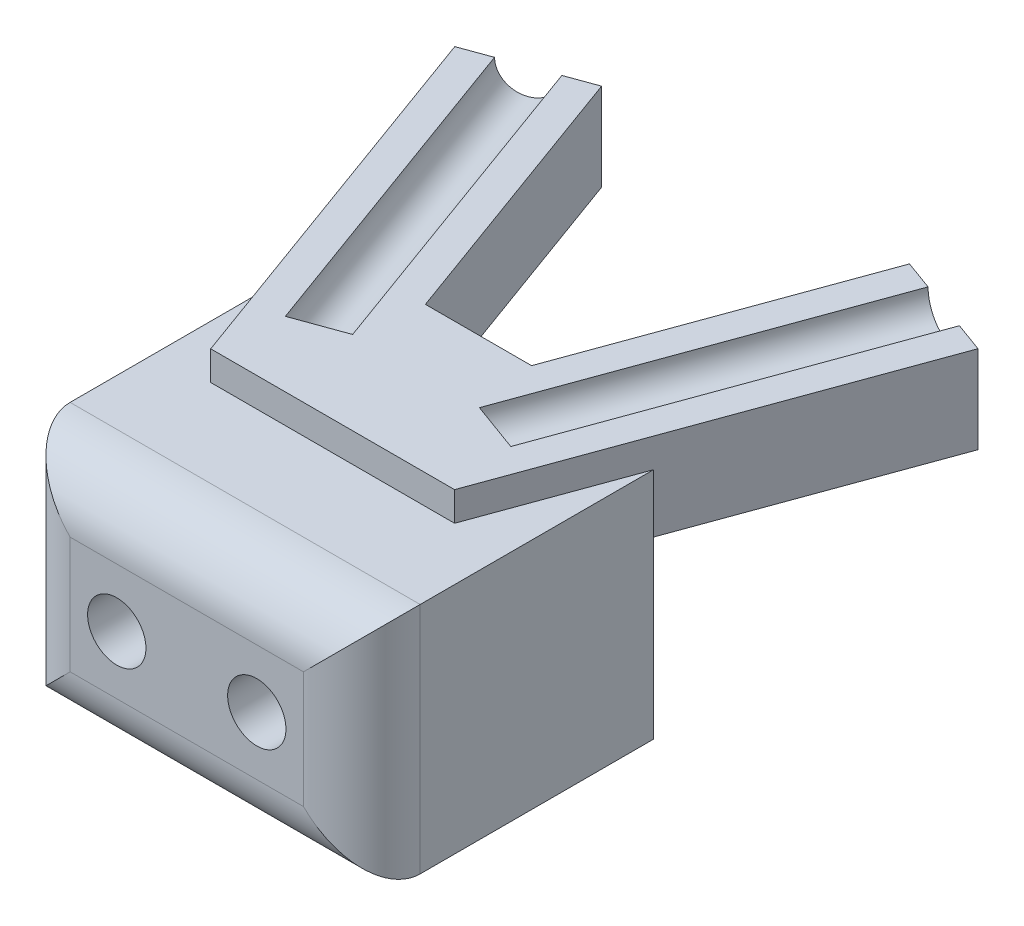
ISO-10303-21;
HEADER;
FILE_DESCRIPTION(('STEP AP214'),'2;1');
FILE_NAME('part.step','',(''),(''),'','','');
FILE_SCHEMA(('AUTOMOTIVE_DESIGN { 1 0 10303 214 1 1 1 1 }'));
ENDSEC;
DATA;
#1=APPLICATION_CONTEXT('core data for automotive mechanical design processes');
#2=APPLICATION_PROTOCOL_DEFINITION('international standard','automotive_design',2000,#1);
#3=PRODUCT_CONTEXT('',#1,'mechanical');
#4=PRODUCT('Part','Part','',(#3));
#5=PRODUCT_RELATED_PRODUCT_CATEGORY('part','',(#4));
#6=PRODUCT_DEFINITION_FORMATION('','',#4);
#7=PRODUCT_DEFINITION_CONTEXT('part definition',#1,'design');
#8=PRODUCT_DEFINITION('design','',#6,#7);
#9=PRODUCT_DEFINITION_SHAPE('','',#8);
#10=(LENGTH_UNIT() NAMED_UNIT(*) SI_UNIT(.MILLI.,.METRE.));
#11=(NAMED_UNIT(*) PLANE_ANGLE_UNIT() SI_UNIT($,.RADIAN.));
#12=(NAMED_UNIT(*) SI_UNIT($,.STERADIAN.) SOLID_ANGLE_UNIT());
#13=UNCERTAINTY_MEASURE_WITH_UNIT(LENGTH_MEASURE(1.E-05),#10,'distance_accuracy_value','');
#14=(GEOMETRIC_REPRESENTATION_CONTEXT(3) GLOBAL_UNCERTAINTY_ASSIGNED_CONTEXT((#13)) GLOBAL_UNIT_ASSIGNED_CONTEXT((#10,
#11,#12)) REPRESENTATION_CONTEXT('',''));
#15=CARTESIAN_POINT('',(0.,0.,0.));
#16=DIRECTION('',(0.,0.,1.));
#17=DIRECTION('',(1.,0.,0.));
#18=AXIS2_PLACEMENT_3D('',#15,#16,#17);
#19=CARTESIAN_POINT('',(0.,2.5,0.));
#20=DIRECTION('',(0.,1.,0.));
#21=DIRECTION('',(0.,0.,1.));
#22=AXIS2_PLACEMENT_3D('',#19,#20,#21);
#23=PLANE('',#22);
#24=DIRECTION('',(0.939692620785908,0.,0.342020143325669));
#25=VECTOR('',#24,1.);
#26=CARTESIAN_POINT('',(1.83514875293571,2.5,-5.04202976003116));
#27=LINE('',#26,#25);
#28=CARTESIAN_POINT('',(3.98428602068269,2.5,-4.25980776521908));
#29=VERTEX_POINT('',#28);
#30=CARTESIAN_POINT('',(4.48421541761415,2.5,-4.07784834550136));
#31=VERTEX_POINT('',#30);
#32=EDGE_CURVE('E210',#29,#31,#27,.T.);
#33=ORIENTED_EDGE('',*,*,#32,.F.);
#34=DIRECTION('',(0.34202014332567,0.,-0.939692620785908));
#35=VECTOR('',#34,1.);
#36=CARTESIAN_POINT('',(1.93216516072868,2.5,1.37834795949637));
#37=LINE('',#36,#35);
#38=CARTESIAN_POINT('',(1.93216516072868,2.5,1.37834795949637));
#39=VERTEX_POINT('',#38);
#40=EDGE_CURVE('E194',#29,#39,#37,.F.);
#41=ORIENTED_EDGE('',*,*,#40,.T.);
#42=DIRECTION('',(-0.939692620785908,0.,-0.34202014332567));
#43=VECTOR('',#42,1.);
#44=CARTESIAN_POINT('',(-0.216972107018303,2.5,0.596125964684276));
#45=LINE('',#44,#43);
#46=CARTESIAN_POINT('',(1.08644180202136,2.5,1.07052983050327));
#47=VERTEX_POINT('',#46);
#48=EDGE_CURVE('E297',#39,#47,#45,.T.);
#49=ORIENTED_EDGE('',*,*,#48,.T.);
#50=DIRECTION('',(0.34202014332567,0.,-0.939692620785908));
#51=VECTOR('',#50,1.);
#52=CARTESIAN_POINT('',(1.08644180202136,2.5,1.07052983050327));
#53=LINE('',#52,#51);
#54=CARTESIAN_POINT('',(3.13856266197538,2.5,-4.56762589421218));
#55=VERTEX_POINT('',#54);
#56=EDGE_CURVE('E205',#47,#55,#53,.T.);
#57=ORIENTED_EDGE('',*,*,#56,.T.);
#58=CARTESIAN_POINT('',(2.63863326504386,2.5,-4.74958531392989));
#59=VERTEX_POINT('',#58);
#60=EDGE_CURVE('E213',#59,#55,#27,.T.);
#61=ORIENTED_EDGE('',*,*,#60,.F.);
#62=DIRECTION('',(0.342020143325713,0.,-0.939692620785892));
#63=VECTOR('',#62,1.);
#64=CARTESIAN_POINT('',(0.803484512107902,2.5,0.292444446101221));
#65=LINE('',#64,#63);
#66=CARTESIAN_POINT('',(0.909925585665229,2.5,0.));
#67=VERTEX_POINT('',#66);
#68=EDGE_CURVE('E219',#67,#59,#65,.T.);
#69=ORIENTED_EDGE('',*,*,#68,.F.);
#70=DIRECTION('',(-1.,0.,0.));
#71=VECTOR('',#70,1.);
#72=CARTESIAN_POINT('',(0.,2.5,0.));
#73=LINE('',#72,#71);
#74=CARTESIAN_POINT('',(-0.909925585665234,2.5,0.));
#75=VERTEX_POINT('',#74);
#76=EDGE_CURVE('E236',#67,#75,#73,.T.);
#77=ORIENTED_EDGE('',*,*,#76,.T.);
#78=DIRECTION('',(-0.342020143325717,0.,-0.939692620785891));
#79=VECTOR('',#78,1.);
#80=CARTESIAN_POINT('',(-0.803484512107904,2.5,0.292444446101226));
#81=LINE('',#80,#79);
#82=CARTESIAN_POINT('',(-2.63863326504389,2.5,-4.74958531392989));
#83=VERTEX_POINT('',#82);
#84=EDGE_CURVE('E401',#75,#83,#81,.T.);
#85=ORIENTED_EDGE('',*,*,#84,.T.);
#86=DIRECTION('',(-0.939692620785908,0.,0.34202014332567));
#87=VECTOR('',#86,1.);
#88=CARTESIAN_POINT('',(-1.83514875293571,2.5,-5.04202976003117));
#89=LINE('',#88,#87);
#90=CARTESIAN_POINT('',(-3.13856266197538,2.5,-4.56762589421218));
#91=VERTEX_POINT('',#90);
#92=EDGE_CURVE('E404',#83,#91,#89,.T.);
#93=ORIENTED_EDGE('',*,*,#92,.T.);
#94=DIRECTION('',(-0.34202014332567,0.,-0.939692620785908));
#95=VECTOR('',#94,1.);
#96=CARTESIAN_POINT('',(-1.08644180202136,2.5,1.07052983050327));
#97=LINE('',#96,#95);
#98=CARTESIAN_POINT('',(-1.08644180202136,2.5,1.07052983050327));
#99=VERTEX_POINT('',#98);
#100=EDGE_CURVE('E295',#99,#91,#97,.T.);
#101=ORIENTED_EDGE('',*,*,#100,.F.);
#102=DIRECTION('',(-0.939692620785908,0.,0.34202014332567));
#103=VECTOR('',#102,1.);
#104=CARTESIAN_POINT('',(0.216972107018303,2.5,0.596125964684276));
#105=LINE('',#104,#103);
#106=CARTESIAN_POINT('',(-1.93216516072867,2.5,1.37834795949637));
#107=VERTEX_POINT('',#106);
#108=EDGE_CURVE('E289',#99,#107,#105,.T.);
#109=ORIENTED_EDGE('',*,*,#108,.T.);
#110=DIRECTION('',(-0.34202014332567,0.,-0.939692620785908));
#111=VECTOR('',#110,1.);
#112=CARTESIAN_POINT('',(-1.93216516072868,2.5,1.37834795949637));
#113=LINE('',#112,#111);
#114=CARTESIAN_POINT('',(-3.98428602068269,2.5,-4.25980776521908));
#115=VERTEX_POINT('',#114);
#116=EDGE_CURVE('E292',#115,#107,#113,.F.);
#117=ORIENTED_EDGE('',*,*,#116,.F.);
#118=CARTESIAN_POINT('',(-4.48421541761418,2.5,-4.07784834550136));
#119=VERTEX_POINT('',#118);
#120=EDGE_CURVE('E403',#115,#119,#89,.T.);
#121=ORIENTED_EDGE('',*,*,#120,.T.);
#122=DIRECTION('',(-0.34202014332567,0.,-0.939692620785908));
#123=VECTOR('',#122,1.);
#124=CARTESIAN_POINT('',(-2.64906666467847,2.5,0.964181414529811));
#125=LINE('',#124,#123);
#126=CARTESIAN_POINT('',(-2.09007441433449,2.5,2.5));
#127=VERTEX_POINT('',#126);
#128=EDGE_CURVE('E407',#127,#119,#125,.T.);
#129=ORIENTED_EDGE('',*,*,#128,.F.);
#130=DIRECTION('',(1.,0.,0.));
#131=VECTOR('',#130,1.);
#132=CARTESIAN_POINT('',(0.,2.5,2.5));
#133=LINE('',#132,#131);
#134=CARTESIAN_POINT('',(2.09007441433451,2.5,2.5));
#135=VERTEX_POINT('',#134);
#136=EDGE_CURVE('E220',#127,#135,#133,.T.);
#137=ORIENTED_EDGE('',*,*,#136,.T.);
#138=DIRECTION('',(0.342020143325664,0.,-0.93969262078591));
#139=VECTOR('',#138,1.);
#140=CARTESIAN_POINT('',(2.64906666467848,2.5,0.964181414529797));
#141=LINE('',#140,#139);
#142=EDGE_CURVE('E216',#135,#31,#141,.T.);
#143=ORIENTED_EDGE('',*,*,#142,.T.);
#144=EDGE_LOOP('',(#33,#41,#49,#57,#61,#69,#77,#85,#93,#101,#109,#117,#121,#129,#137,#143));
#145=FACE_BOUND('',#144,.T.);
#146=ADVANCED_FACE('F62',(#145),#23,.T.);
#147=CARTESIAN_POINT('',(0.,0.,0.));
#148=DIRECTION('',(0.,0.,1.));
#149=DIRECTION('',(1.,0.,0.));
#150=AXIS2_PLACEMENT_3D('',#147,#148,#149);
#151=PLANE('',#150);
#152=CARTESIAN_POINT('',(-1.2,0.,0.));
#153=DIRECTION('',(0.,0.,-1.));
#154=DIRECTION('',(1.,0.,0.));
#155=AXIS2_PLACEMENT_3D('',#152,#153,#154);
#156=CIRCLE('',#155,0.500000000000001);
#157=CARTESIAN_POINT('',(-0.699999999999999,0.,0.));
#158=VERTEX_POINT('',#157);
#159=EDGE_CURVE('E261',#158,#158,#156,.T.);
#160=ORIENTED_EDGE('',*,*,#159,.F.);
#161=EDGE_LOOP('',(#160));
#162=FACE_BOUND('',#161,.T.);
#163=CARTESIAN_POINT('',(1.2,0.,0.));
#164=DIRECTION('',(0.,0.,-1.));
#165=DIRECTION('',(-1.,0.,0.));
#166=AXIS2_PLACEMENT_3D('',#163,#164,#165);
#167=CIRCLE('',#166,0.5);
#168=CARTESIAN_POINT('',(0.7,0.,0.));
#169=VERTEX_POINT('',#168);
#170=EDGE_CURVE('E258',#169,#169,#167,.T.);
#171=ORIENTED_EDGE('',*,*,#170,.F.);
#172=EDGE_LOOP('',(#171));
#173=FACE_BOUND('',#172,.T.);
#174=DIRECTION('',(0.,-1.,0.));
#175=VECTOR('',#174,1.);
#176=CARTESIAN_POINT('',(0.909925585665229,2.5,0.));
#177=LINE('',#176,#175);
#178=CARTESIAN_POINT('',(0.909925585665229,1.,0.));
#179=VERTEX_POINT('',#178);
#180=EDGE_CURVE('E226',#67,#179,#177,.T.);
#181=ORIENTED_EDGE('',*,*,#180,.T.);
#182=DIRECTION('',(-1.,0.,0.));
#183=VECTOR('',#182,1.);
#184=CARTESIAN_POINT('',(0.,1.,0.));
#185=LINE('',#184,#183);
#186=CARTESIAN_POINT('',(3.,1.,0.));
#187=VERTEX_POINT('',#186);
#188=EDGE_CURVE('E286',#187,#179,#185,.T.);
#189=ORIENTED_EDGE('',*,*,#188,.F.);
#190=DIRECTION('',(0.,1.,0.));
#191=VECTOR('',#190,1.);
#192=CARTESIAN_POINT('',(3.,2.,0.));
#193=LINE('',#192,#191);
#194=CARTESIAN_POINT('',(3.,-2.,0.));
#195=VERTEX_POINT('',#194);
#196=EDGE_CURVE('E257',#195,#187,#193,.T.);
#197=ORIENTED_EDGE('',*,*,#196,.F.);
#198=DIRECTION('',(1.,0.,0.));
#199=VECTOR('',#198,1.);
#200=CARTESIAN_POINT('',(-3.,-2.,0.));
#201=LINE('',#200,#199);
#202=CARTESIAN_POINT('',(-3.,-2.,0.));
#203=VERTEX_POINT('',#202);
#204=EDGE_CURVE('E272',#203,#195,#201,.T.);
#205=ORIENTED_EDGE('',*,*,#204,.F.);
#206=DIRECTION('',(0.,-1.,0.));
#207=VECTOR('',#206,1.);
#208=CARTESIAN_POINT('',(-3.,2.,0.));
#209=LINE('',#208,#207);
#210=CARTESIAN_POINT('',(-3.,1.,0.));
#211=VERTEX_POINT('',#210);
#212=EDGE_CURVE('E268',#211,#203,#209,.T.);
#213=ORIENTED_EDGE('',*,*,#212,.F.);
#214=DIRECTION('',(-1.,0.,0.));
#215=VECTOR('',#214,1.);
#216=CARTESIAN_POINT('',(0.,1.,0.));
#217=LINE('',#216,#215);
#218=CARTESIAN_POINT('',(-0.909925585665234,1.,0.));
#219=VERTEX_POINT('',#218);
#220=EDGE_CURVE('E283',#219,#211,#217,.T.);
#221=ORIENTED_EDGE('',*,*,#220,.F.);
#222=DIRECTION('',(0.,-1.,0.));
#223=VECTOR('',#222,1.);
#224=CARTESIAN_POINT('',(-0.909925585665234,2.5,0.));
#225=LINE('',#224,#223);
#226=EDGE_CURVE('E251',#75,#219,#225,.T.);
#227=ORIENTED_EDGE('',*,*,#226,.F.);
#228=ORIENTED_EDGE('',*,*,#76,.F.);
#229=EDGE_LOOP('',(#181,#189,#197,#205,#213,#221,#227,#228));
#230=FACE_BOUND('',#229,.T.);
#231=ADVANCED_FACE('F359',(#162,#173,#230),#151,.F.);
#232=CARTESIAN_POINT('',(-3.,2.,5.));
#233=DIRECTION('',(0.,-1.,0.));
#234=DIRECTION('',(0.,0.,-1.));
#235=AXIS2_PLACEMENT_3D('',#232,#233,#234);
#236=PLANE('',#235);
#237=DIRECTION('',(0.,0.,-1.));
#238=VECTOR('',#237,1.);
#239=CARTESIAN_POINT('',(-3.,2.,5.));
#240=LINE('',#239,#238);
#241=CARTESIAN_POINT('',(-3.,2.,4.));
#242=VERTEX_POINT('',#241);
#243=CARTESIAN_POINT('',(-3.,2.,0.));
#244=VERTEX_POINT('',#243);
#245=EDGE_CURVE('E279',#242,#244,#240,.T.);
#246=ORIENTED_EDGE('',*,*,#245,.F.);
#247=DIRECTION('',(-1.,0.,0.));
#248=VECTOR('',#247,1.);
#249=CARTESIAN_POINT('',(3.,2.,4.));
#250=LINE('',#249,#248);
#251=CARTESIAN_POINT('',(3.,2.,4.));
#252=VERTEX_POINT('',#251);
#253=EDGE_CURVE('E12',#242,#252,#250,.F.);
#254=ORIENTED_EDGE('',*,*,#253,.T.);
#255=DIRECTION('',(0.,0.,-1.));
#256=VECTOR('',#255,1.);
#257=CARTESIAN_POINT('',(3.,2.,5.));
#258=LINE('',#257,#256);
#259=CARTESIAN_POINT('',(3.,2.,0.));
#260=VERTEX_POINT('',#259);
#261=EDGE_CURVE('E281',#252,#260,#258,.T.);
#262=ORIENTED_EDGE('',*,*,#261,.T.);
#263=DIRECTION('',(0.342020143325664,0.,-0.93969262078591));
#264=VECTOR('',#263,1.);
#265=CARTESIAN_POINT('',(2.64906666467848,2.,0.964181414529797));
#266=LINE('',#265,#264);
#267=CARTESIAN_POINT('',(2.09007441433451,2.,2.5));
#268=VERTEX_POINT('',#267);
#269=EDGE_CURVE('E233',#268,#260,#266,.T.);
#270=ORIENTED_EDGE('',*,*,#269,.F.);
#271=DIRECTION('',(1.,0.,0.));
#272=VECTOR('',#271,1.);
#273=CARTESIAN_POINT('',(0.,2.,2.5));
#274=LINE('',#273,#272);
#275=CARTESIAN_POINT('',(-2.09007441433449,2.,2.5));
#276=VERTEX_POINT('',#275);
#277=EDGE_CURVE('E230',#276,#268,#274,.T.);
#278=ORIENTED_EDGE('',*,*,#277,.F.);
#279=DIRECTION('',(-0.34202014332567,0.,-0.939692620785908));
#280=VECTOR('',#279,1.);
#281=CARTESIAN_POINT('',(-2.64906666467847,2.,0.964181414529811));
#282=LINE('',#281,#280);
#283=EDGE_CURVE('E227',#276,#244,#282,.T.);
#284=ORIENTED_EDGE('',*,*,#283,.T.);
#285=EDGE_LOOP('',(#246,#254,#262,#270,#278,#284));
#286=FACE_BOUND('',#285,.T.);
#287=ADVANCED_FACE('F362',(#286),#236,.F.);
#288=CARTESIAN_POINT('',(3.,2.,5.));
#289=DIRECTION('',(-1.,0.,0.));
#290=DIRECTION('',(0.,0.,1.));
#291=AXIS2_PLACEMENT_3D('',#288,#289,#290);
#292=PLANE('',#291);
#293=ORIENTED_EDGE('',*,*,#261,.F.);
#294=DIRECTION('',(0.,1.,0.));
#295=VECTOR('',#294,1.);
#296=CARTESIAN_POINT('',(3.,-2.,4.));
#297=LINE('',#296,#295);
#298=CARTESIAN_POINT('',(3.,-2.,4.));
#299=VERTEX_POINT('',#298);
#300=EDGE_CURVE('E79',#252,#299,#297,.F.);
#301=ORIENTED_EDGE('',*,*,#300,.T.);
#302=DIRECTION('',(0.,0.,-1.));
#303=VECTOR('',#302,1.);
#304=CARTESIAN_POINT('',(3.,-2.,5.));
#305=LINE('',#304,#303);
#306=EDGE_CURVE('E275',#299,#195,#305,.T.);
#307=ORIENTED_EDGE('',*,*,#306,.T.);
#308=ORIENTED_EDGE('',*,*,#196,.T.);
#309=DIRECTION('',(0.,1.,0.));
#310=VECTOR('',#309,1.);
#311=CARTESIAN_POINT('',(3.,0.,0.));
#312=LINE('',#311,#310);
#313=EDGE_CURVE('E385',#187,#260,#312,.T.);
#314=ORIENTED_EDGE('',*,*,#313,.T.);
#315=EDGE_LOOP('',(#293,#301,#307,#308,#314));
#316=FACE_BOUND('',#315,.T.);
#317=ADVANCED_FACE('F444',(#316),#292,.F.);
#318=CARTESIAN_POINT('',(-3.,2.,5.));
#319=DIRECTION('',(1.,0.,0.));
#320=DIRECTION('',(0.,1.,0.));
#321=AXIS2_PLACEMENT_3D('',#318,#319,#320);
#322=PLANE('',#321);
#323=DIRECTION('',(0.,0.,-1.));
#324=VECTOR('',#323,1.);
#325=CARTESIAN_POINT('',(-3.,-2.,5.));
#326=LINE('',#325,#324);
#327=CARTESIAN_POINT('',(-3.,-2.,4.));
#328=VERTEX_POINT('',#327);
#329=EDGE_CURVE('E277',#328,#203,#326,.T.);
#330=ORIENTED_EDGE('',*,*,#329,.F.);
#331=DIRECTION('',(0.,-1.,0.));
#332=VECTOR('',#331,1.);
#333=CARTESIAN_POINT('',(-3.,2.,4.));
#334=LINE('',#333,#332);
#335=EDGE_CURVE('E308',#328,#242,#334,.F.);
#336=ORIENTED_EDGE('',*,*,#335,.T.);
#337=ORIENTED_EDGE('',*,*,#245,.T.);
#338=EDGE_CURVE('E269',#244,#211,#209,.T.);
#339=ORIENTED_EDGE('',*,*,#338,.T.);
#340=ORIENTED_EDGE('',*,*,#212,.T.);
#341=EDGE_LOOP('',(#330,#336,#337,#339,#340));
#342=FACE_BOUND('',#341,.T.);
#343=ADVANCED_FACE('F338',(#342),#322,.F.);
#344=CARTESIAN_POINT('',(-3.,-2.,5.));
#345=DIRECTION('',(0.,1.,0.));
#346=DIRECTION('',(0.,0.,1.));
#347=AXIS2_PLACEMENT_3D('',#344,#345,#346);
#348=PLANE('',#347);
#349=ORIENTED_EDGE('',*,*,#306,.F.);
#350=DIRECTION('',(1.,0.,0.));
#351=VECTOR('',#350,1.);
#352=CARTESIAN_POINT('',(-3.,-2.,4.));
#353=LINE('',#352,#351);
#354=EDGE_CURVE('E71',#299,#328,#353,.F.);
#355=ORIENTED_EDGE('',*,*,#354,.T.);
#356=ORIENTED_EDGE('',*,*,#329,.T.);
#357=ORIENTED_EDGE('',*,*,#204,.T.);
#358=EDGE_LOOP('',(#349,#355,#356,#357));
#359=FACE_BOUND('',#358,.T.);
#360=ADVANCED_FACE('F334',(#359),#348,.F.);
#361=CARTESIAN_POINT('',(0.,0.,5.));
#362=DIRECTION('',(0.,0.,1.));
#363=DIRECTION('',(1.,0.,0.));
#364=AXIS2_PLACEMENT_3D('',#361,#362,#363);
#365=PLANE('',#364);
#366=DIRECTION('',(0.,-1.,0.));
#367=VECTOR('',#366,1.);
#368=CARTESIAN_POINT('',(-2.,-2.,5.));
#369=LINE('',#368,#367);
#370=CARTESIAN_POINT('',(-2.,1.,5.));
#371=VERTEX_POINT('',#370);
#372=CARTESIAN_POINT('',(-2.,-1.,5.));
#373=VERTEX_POINT('',#372);
#374=EDGE_CURVE('E303',#371,#373,#369,.T.);
#375=ORIENTED_EDGE('',*,*,#374,.T.);
#376=DIRECTION('',(1.,0.,0.));
#377=VECTOR('',#376,1.);
#378=CARTESIAN_POINT('',(3.,-1.,5.));
#379=LINE('',#378,#377);
#380=CARTESIAN_POINT('',(2.,-1.,5.));
#381=VERTEX_POINT('',#380);
#382=EDGE_CURVE('E306',#373,#381,#379,.T.);
#383=ORIENTED_EDGE('',*,*,#382,.T.);
#384=DIRECTION('',(0.,1.,0.));
#385=VECTOR('',#384,1.);
#386=CARTESIAN_POINT('',(2.,2.,5.));
#387=LINE('',#386,#385);
#388=CARTESIAN_POINT('',(2.,1.,5.));
#389=VERTEX_POINT('',#388);
#390=EDGE_CURVE('E301',#381,#389,#387,.T.);
#391=ORIENTED_EDGE('',*,*,#390,.T.);
#392=DIRECTION('',(-1.,0.,0.));
#393=VECTOR('',#392,1.);
#394=CARTESIAN_POINT('',(-3.,1.,5.));
#395=LINE('',#394,#393);
#396=EDGE_CURVE('E204',#389,#371,#395,.T.);
#397=ORIENTED_EDGE('',*,*,#396,.T.);
#398=EDGE_LOOP('',(#375,#383,#391,#397));
#399=FACE_BOUND('',#398,.T.);
#400=CARTESIAN_POINT('',(1.2,0.,5.));
#401=DIRECTION('',(0.,0.,-1.));
#402=DIRECTION('',(-1.,0.,0.));
#403=AXIS2_PLACEMENT_3D('',#400,#401,#402);
#404=CIRCLE('',#403,0.5);
#405=CARTESIAN_POINT('',(0.7,0.,5.));
#406=VERTEX_POINT('',#405);
#407=EDGE_CURVE('E254',#406,#406,#404,.T.);
#408=ORIENTED_EDGE('',*,*,#407,.T.);
#409=EDGE_LOOP('',(#408));
#410=FACE_BOUND('',#409,.T.);
#411=CARTESIAN_POINT('',(-1.2,0.,5.));
#412=DIRECTION('',(0.,0.,-1.));
#413=DIRECTION('',(1.,0.,0.));
#414=AXIS2_PLACEMENT_3D('',#411,#412,#413);
#415=CIRCLE('',#414,0.500000000000001);
#416=CARTESIAN_POINT('',(-0.699999999999999,0.,5.));
#417=VERTEX_POINT('',#416);
#418=EDGE_CURVE('E253',#417,#417,#415,.T.);
#419=ORIENTED_EDGE('',*,*,#418,.T.);
#420=EDGE_LOOP('',(#419));
#421=FACE_BOUND('',#420,.T.);
#422=ADVANCED_FACE('F344',(#399,#410,#421),#365,.T.);
#423=CARTESIAN_POINT('',(-1.2,0.,5.));
#424=DIRECTION('',(0.,0.,-1.));
#425=DIRECTION('',(-1.,0.,0.));
#426=AXIS2_PLACEMENT_3D('',#423,#424,#425);
#427=CYLINDRICAL_SURFACE('',#426,0.500000000000001);
#428=ORIENTED_EDGE('',*,*,#418,.F.);
#429=EDGE_LOOP('',(#428));
#430=FACE_BOUND('',#429,.T.);
#431=ORIENTED_EDGE('',*,*,#159,.T.);
#432=EDGE_LOOP('',(#431));
#433=FACE_BOUND('',#432,.T.);
#434=ADVANCED_FACE('F347',(#430,#433),#427,.F.);
#435=CARTESIAN_POINT('',(1.2,0.,5.));
#436=DIRECTION('',(0.,0.,-1.));
#437=DIRECTION('',(-1.,0.,0.));
#438=AXIS2_PLACEMENT_3D('',#435,#436,#437);
#439=CYLINDRICAL_SURFACE('',#438,0.5);
#440=ORIENTED_EDGE('',*,*,#407,.F.);
#441=EDGE_LOOP('',(#440));
#442=FACE_BOUND('',#441,.T.);
#443=ORIENTED_EDGE('',*,*,#170,.T.);
#444=EDGE_LOOP('',(#443));
#445=FACE_BOUND('',#444,.T.);
#446=ADVANCED_FACE('F355',(#442,#445),#439,.F.);
#447=CARTESIAN_POINT('',(-0.803484512107904,2.5,0.292444446101226));
#448=DIRECTION('',(-0.939692620785891,0.,0.342020143325717));
#449=DIRECTION('',(0.342020143325717,0.,0.939692620785891));
#450=AXIS2_PLACEMENT_3D('',#447,#448,#449);
#451=PLANE('',#450);
#452=ORIENTED_EDGE('',*,*,#226,.T.);
#453=DIRECTION('',(-0.342020143325717,0.,-0.939692620785891));
#454=VECTOR('',#453,1.);
#455=CARTESIAN_POINT('',(-0.803484512107904,1.,0.292444446101226));
#456=LINE('',#455,#454);
#457=CARTESIAN_POINT('',(-2.63863326504389,1.,-4.74958531392989));
#458=VERTEX_POINT('',#457);
#459=EDGE_CURVE('E392',#219,#458,#456,.T.);
#460=ORIENTED_EDGE('',*,*,#459,.T.);
#461=DIRECTION('',(0.,-1.,0.));
#462=VECTOR('',#461,1.);
#463=CARTESIAN_POINT('',(-2.63863326504389,2.5,-4.74958531392989));
#464=LINE('',#463,#462);
#465=EDGE_CURVE('E249',#83,#458,#464,.T.);
#466=ORIENTED_EDGE('',*,*,#465,.F.);
#467=ORIENTED_EDGE('',*,*,#84,.F.);
#468=EDGE_LOOP('',(#452,#460,#466,#467));
#469=FACE_BOUND('',#468,.T.);
#470=ADVANCED_FACE('F451',(#469),#451,.F.);
#471=CARTESIAN_POINT('',(-1.83514875293571,2.5,-5.04202976003117));
#472=DIRECTION('',(0.34202014332567,0.,0.939692620785908));
#473=DIRECTION('',(0.939692620785908,0.,-0.34202014332567));
#474=AXIS2_PLACEMENT_3D('',#471,#472,#473);
#475=PLANE('',#474);
#476=ORIENTED_EDGE('',*,*,#120,.F.);
#477=CARTESIAN_POINT('',(-3.56142434132903,2.5,-4.41371682971563));
#478=DIRECTION('',(-0.34202014332567,0.,-0.939692620785908));
#479=DIRECTION('',(-0.939692620785908,0.,0.34202014332567));
#480=AXIS2_PLACEMENT_3D('',#477,#478,#479);
#481=CIRCLE('',#480,0.45);
#482=EDGE_CURVE('E421',#91,#115,#481,.T.);
#483=ORIENTED_EDGE('',*,*,#482,.F.);
#484=ORIENTED_EDGE('',*,*,#92,.F.);
#485=ORIENTED_EDGE('',*,*,#465,.T.);
#486=DIRECTION('',(-0.939692620785908,0.,0.34202014332567));
#487=VECTOR('',#486,1.);
#488=CARTESIAN_POINT('',(-1.83514875293571,1.,-5.04202976003117));
#489=LINE('',#488,#487);
#490=CARTESIAN_POINT('',(-4.48421541761418,1.,-4.07784834550136));
#491=VERTEX_POINT('',#490);
#492=EDGE_CURVE('E395',#458,#491,#489,.T.);
#493=ORIENTED_EDGE('',*,*,#492,.T.);
#494=DIRECTION('',(0.,-1.,0.));
#495=VECTOR('',#494,1.);
#496=CARTESIAN_POINT('',(-4.48421541761418,2.5,-4.07784834550136));
#497=LINE('',#496,#495);
#498=EDGE_CURVE('E247',#119,#491,#497,.T.);
#499=ORIENTED_EDGE('',*,*,#498,.F.);
#500=EDGE_LOOP('',(#476,#483,#484,#485,#493,#499));
#501=FACE_BOUND('',#500,.T.);
#502=ADVANCED_FACE('F436',(#501),#475,.F.);
#503=CARTESIAN_POINT('',(-2.64906666467847,2.5,0.964181414529811));
#504=DIRECTION('',(-0.939692620785908,0.,0.342020143325669));
#505=DIRECTION('',(0.34202014332567,0.,0.939692620785908));
#506=AXIS2_PLACEMENT_3D('',#503,#504,#505);
#507=PLANE('',#506);
#508=ORIENTED_EDGE('',*,*,#283,.F.);
#509=DIRECTION('',(0.,-1.,0.));
#510=VECTOR('',#509,1.);
#511=CARTESIAN_POINT('',(-2.09007441433449,2.5,2.5));
#512=LINE('',#511,#510);
#513=EDGE_CURVE('E245',#127,#276,#512,.T.);
#514=ORIENTED_EDGE('',*,*,#513,.F.);
#515=ORIENTED_EDGE('',*,*,#128,.T.);
#516=ORIENTED_EDGE('',*,*,#498,.T.);
#517=DIRECTION('',(-0.34202014332567,0.,-0.939692620785908));
#518=VECTOR('',#517,1.);
#519=CARTESIAN_POINT('',(-2.64906666467847,1.,0.964181414529811));
#520=LINE('',#519,#518);
#521=EDGE_CURVE('E231',#211,#491,#520,.T.);
#522=ORIENTED_EDGE('',*,*,#521,.F.);
#523=ORIENTED_EDGE('',*,*,#338,.F.);
#524=EDGE_LOOP('',(#508,#514,#515,#516,#522,#523));
#525=FACE_BOUND('',#524,.T.);
#526=ADVANCED_FACE('F442',(#525),#507,.T.);
#527=CARTESIAN_POINT('',(0.,2.5,2.5));
#528=DIRECTION('',(0.,0.,-1.));
#529=DIRECTION('',(-1.,0.,0.));
#530=AXIS2_PLACEMENT_3D('',#527,#528,#529);
#531=PLANE('',#530);
#532=ORIENTED_EDGE('',*,*,#277,.T.);
#533=DIRECTION('',(0.,-1.,0.));
#534=VECTOR('',#533,1.);
#535=CARTESIAN_POINT('',(2.09007441433451,2.5,2.5));
#536=LINE('',#535,#534);
#537=EDGE_CURVE('E242',#135,#268,#536,.T.);
#538=ORIENTED_EDGE('',*,*,#537,.F.);
#539=ORIENTED_EDGE('',*,*,#136,.F.);
#540=ORIENTED_EDGE('',*,*,#513,.T.);
#541=EDGE_LOOP('',(#532,#538,#539,#540));
#542=FACE_BOUND('',#541,.T.);
#543=ADVANCED_FACE('F413',(#542),#531,.F.);
#544=CARTESIAN_POINT('',(2.64906666467848,2.5,0.964181414529797));
#545=DIRECTION('',(-0.93969262078591,0.,-0.342020143325664));
#546=DIRECTION('',(-0.342020143325664,0.,0.93969262078591));
#547=AXIS2_PLACEMENT_3D('',#544,#545,#546);
#548=PLANE('',#547);
#549=ORIENTED_EDGE('',*,*,#269,.T.);
#550=ORIENTED_EDGE('',*,*,#313,.F.);
#551=DIRECTION('',(0.342020143325664,0.,-0.93969262078591));
#552=VECTOR('',#551,1.);
#553=CARTESIAN_POINT('',(2.64906666467848,1.,0.964181414529797));
#554=LINE('',#553,#552);
#555=CARTESIAN_POINT('',(4.48421541761415,1.,-4.07784834550136));
#556=VERTEX_POINT('',#555);
#557=EDGE_CURVE('E381',#187,#556,#554,.T.);
#558=ORIENTED_EDGE('',*,*,#557,.T.);
#559=DIRECTION('',(0.,-1.,0.));
#560=VECTOR('',#559,1.);
#561=CARTESIAN_POINT('',(4.48421541761415,2.5,-4.07784834550136));
#562=LINE('',#561,#560);
#563=EDGE_CURVE('E240',#31,#556,#562,.T.);
#564=ORIENTED_EDGE('',*,*,#563,.F.);
#565=ORIENTED_EDGE('',*,*,#142,.F.);
#566=ORIENTED_EDGE('',*,*,#537,.T.);
#567=EDGE_LOOP('',(#549,#550,#558,#564,#565,#566));
#568=FACE_BOUND('',#567,.T.);
#569=ADVANCED_FACE('F417',(#568),#548,.F.);
#570=CARTESIAN_POINT('',(1.83514875293571,2.5,-5.04202976003116));
#571=DIRECTION('',(0.342020143325669,0.,-0.939692620785908));
#572=DIRECTION('',(-0.939692620785908,0.,-0.342020143325669));
#573=AXIS2_PLACEMENT_3D('',#570,#571,#572);
#574=PLANE('',#573);
#575=ORIENTED_EDGE('',*,*,#60,.T.);
#576=CARTESIAN_POINT('',(3.56142434132903,2.5,-4.41371682971563));
#577=DIRECTION('',(-0.34202014332567,0.,0.939692620785908));
#578=DIRECTION('',(0.939692620785908,0.,0.34202014332567));
#579=AXIS2_PLACEMENT_3D('',#576,#577,#578);
#580=CIRCLE('',#579,0.45);
#581=EDGE_CURVE('E198',#55,#29,#580,.T.);
#582=ORIENTED_EDGE('',*,*,#581,.T.);
#583=ORIENTED_EDGE('',*,*,#32,.T.);
#584=ORIENTED_EDGE('',*,*,#563,.T.);
#585=DIRECTION('',(0.939692620785908,0.,0.342020143325669));
#586=VECTOR('',#585,1.);
#587=CARTESIAN_POINT('',(1.83514875293571,1.,-5.04202976003116));
#588=LINE('',#587,#586);
#589=CARTESIAN_POINT('',(2.63863326504386,1.,-4.74958531392989));
#590=VERTEX_POINT('',#589);
#591=EDGE_CURVE('E383',#590,#556,#588,.T.);
#592=ORIENTED_EDGE('',*,*,#591,.F.);
#593=DIRECTION('',(0.,-1.,0.));
#594=VECTOR('',#593,1.);
#595=CARTESIAN_POINT('',(2.63863326504386,2.5,-4.74958531392989));
#596=LINE('',#595,#594);
#597=EDGE_CURVE('E238',#59,#590,#596,.T.);
#598=ORIENTED_EDGE('',*,*,#597,.F.);
#599=EDGE_LOOP('',(#575,#582,#583,#584,#592,#598));
#600=FACE_BOUND('',#599,.T.);
#601=ADVANCED_FACE('F209',(#600),#574,.T.);
#602=CARTESIAN_POINT('',(0.803484512107902,2.5,0.292444446101221));
#603=DIRECTION('',(-0.939692620785892,0.,-0.342020143325713));
#604=DIRECTION('',(-0.342020143325713,0.,0.939692620785892));
#605=AXIS2_PLACEMENT_3D('',#602,#603,#604);
#606=PLANE('',#605);
#607=ORIENTED_EDGE('',*,*,#597,.T.);
#608=DIRECTION('',(0.342020143325713,0.,-0.939692620785892));
#609=VECTOR('',#608,1.);
#610=CARTESIAN_POINT('',(0.803484512107902,1.,0.292444446101221));
#611=LINE('',#610,#609);
#612=EDGE_CURVE('E378',#179,#590,#611,.T.);
#613=ORIENTED_EDGE('',*,*,#612,.F.);
#614=ORIENTED_EDGE('',*,*,#180,.F.);
#615=ORIENTED_EDGE('',*,*,#68,.T.);
#616=EDGE_LOOP('',(#607,#613,#614,#615));
#617=FACE_BOUND('',#616,.T.);
#618=ADVANCED_FACE('F382',(#617),#606,.T.);
#619=CARTESIAN_POINT('',(0.,1.,0.));
#620=DIRECTION('',(0.,1.,0.));
#621=DIRECTION('',(0.,0.,1.));
#622=AXIS2_PLACEMENT_3D('',#619,#620,#621);
#623=PLANE('',#622);
#624=ORIENTED_EDGE('',*,*,#459,.F.);
#625=ORIENTED_EDGE('',*,*,#220,.T.);
#626=ORIENTED_EDGE('',*,*,#521,.T.);
#627=ORIENTED_EDGE('',*,*,#492,.F.);
#628=EDGE_LOOP('',(#624,#625,#626,#627));
#629=FACE_BOUND('',#628,.T.);
#630=ADVANCED_FACE('F448',(#629),#623,.F.);
#631=CARTESIAN_POINT('',(0.,1.,0.));
#632=DIRECTION('',(0.,1.,0.));
#633=DIRECTION('',(0.,0.,1.));
#634=AXIS2_PLACEMENT_3D('',#631,#632,#633);
#635=PLANE('',#634);
#636=ORIENTED_EDGE('',*,*,#557,.F.);
#637=ORIENTED_EDGE('',*,*,#188,.T.);
#638=ORIENTED_EDGE('',*,*,#612,.T.);
#639=ORIENTED_EDGE('',*,*,#591,.T.);
#640=EDGE_LOOP('',(#636,#637,#638,#639));
#641=FACE_BOUND('',#640,.T.);
#642=ADVANCED_FACE('F376',(#641),#635,.F.);
#643=CARTESIAN_POINT('',(-1.50930348137502,2.5,1.22443889499982));
#644=DIRECTION('',(-0.34202014332567,0.,-0.939692620785908));
#645=DIRECTION('',(-0.939692620785908,0.,0.34202014332567));
#646=AXIS2_PLACEMENT_3D('',#643,#644,#645);
#647=CYLINDRICAL_SURFACE('',#646,0.45);
#648=ORIENTED_EDGE('',*,*,#100,.T.);
#649=ORIENTED_EDGE('',*,*,#482,.T.);
#650=ORIENTED_EDGE('',*,*,#116,.T.);
#651=CARTESIAN_POINT('',(-1.50930348137502,2.5,1.22443889499982));
#652=DIRECTION('',(-0.34202014332567,0.,-0.939692620785908));
#653=DIRECTION('',(-0.939692620785908,0.,0.34202014332567));
#654=AXIS2_PLACEMENT_3D('',#651,#652,#653);
#655=CIRCLE('',#654,0.45);
#656=EDGE_CURVE('E387',#99,#107,#655,.T.);
#657=ORIENTED_EDGE('',*,*,#656,.F.);
#658=EDGE_LOOP('',(#648,#649,#650,#657));
#659=FACE_BOUND('',#658,.T.);
#660=ADVANCED_FACE('F431',(#659),#647,.F.);
#661=CARTESIAN_POINT('',(-1.50930348137502,2.5,1.22443889499982));
#662=DIRECTION('',(-0.34202014332567,0.,-0.939692620785908));
#663=DIRECTION('',(-0.939692620785908,0.,0.34202014332567));
#664=AXIS2_PLACEMENT_3D('',#661,#662,#663);
#665=PLANE('',#664);
#666=ORIENTED_EDGE('',*,*,#656,.T.);
#667=ORIENTED_EDGE('',*,*,#108,.F.);
#668=EDGE_LOOP('',(#666,#667));
#669=FACE_BOUND('',#668,.T.);
#670=ADVANCED_FACE('F427',(#669),#665,.T.);
#671=CARTESIAN_POINT('',(1.50930348137502,2.5,1.22443889499982));
#672=DIRECTION('',(0.34202014332567,0.,-0.939692620785908));
#673=DIRECTION('',(-0.939692620785908,0.,-0.34202014332567));
#674=AXIS2_PLACEMENT_3D('',#671,#672,#673);
#675=CYLINDRICAL_SURFACE('',#674,0.45);
#676=ORIENTED_EDGE('',*,*,#581,.F.);
#677=ORIENTED_EDGE('',*,*,#56,.F.);
#678=CARTESIAN_POINT('',(1.50930348137502,2.5,1.22443889499982));
#679=DIRECTION('',(-0.34202014332567,0.,0.939692620785908));
#680=DIRECTION('',(0.939692620785908,0.,0.34202014332567));
#681=AXIS2_PLACEMENT_3D('',#678,#679,#680);
#682=CIRCLE('',#681,0.45);
#683=EDGE_CURVE('E200',#47,#39,#682,.T.);
#684=ORIENTED_EDGE('',*,*,#683,.T.);
#685=ORIENTED_EDGE('',*,*,#40,.F.);
#686=EDGE_LOOP('',(#676,#677,#684,#685));
#687=FACE_BOUND('',#686,.T.);
#688=ADVANCED_FACE('F196',(#687),#675,.F.);
#689=CARTESIAN_POINT('',(1.50930348137502,2.5,1.22443889499982));
#690=DIRECTION('',(0.34202014332567,0.,-0.939692620785908));
#691=DIRECTION('',(0.939692620785908,0.,0.34202014332567));
#692=AXIS2_PLACEMENT_3D('',#689,#690,#691);
#693=PLANE('',#692);
#694=ORIENTED_EDGE('',*,*,#683,.F.);
#695=ORIENTED_EDGE('',*,*,#48,.F.);
#696=EDGE_LOOP('',(#694,#695));
#697=FACE_BOUND('',#696,.T.);
#698=ADVANCED_FACE('F420',(#697),#693,.T.);
#699=CARTESIAN_POINT('',(2.,0.,4.));
#700=DIRECTION('',(0.,-1.,0.));
#701=DIRECTION('',(0.,0.,-1.));
#702=AXIS2_PLACEMENT_3D('',#699,#700,#701);
#703=CYLINDRICAL_SURFACE('',#702,1.);
#704=CARTESIAN_POINT('',(2.,-1.,4.));
#705=DIRECTION('',(-0.707106781186547,-0.707106781186547,0.));
#706=DIRECTION('',(-0.707106781186547,0.707106781186547,0.));
#707=AXIS2_PLACEMENT_3D('',#704,#705,#706);
#708=ELLIPSE('',#707,1.41421356237309,1.);
#709=EDGE_CURVE('E316',#299,#381,#708,.T.);
#710=ORIENTED_EDGE('',*,*,#709,.F.);
#711=ORIENTED_EDGE('',*,*,#300,.F.);
#712=CARTESIAN_POINT('',(2.,1.,4.));
#713=DIRECTION('',(0.707106781186547,-0.707106781186547,0.));
#714=DIRECTION('',(0.707106781186547,0.707106781186547,0.));
#715=AXIS2_PLACEMENT_3D('',#712,#713,#714);
#716=ELLIPSE('',#715,1.41421356237309,1.);
#717=EDGE_CURVE('E66',#389,#252,#716,.F.);
#718=ORIENTED_EDGE('',*,*,#717,.F.);
#719=ORIENTED_EDGE('',*,*,#390,.F.);
#720=EDGE_LOOP('',(#710,#711,#718,#719));
#721=FACE_BOUND('',#720,.T.);
#722=ADVANCED_FACE('F64',(#721),#703,.T.);
#723=CARTESIAN_POINT('',(0.,1.,4.));
#724=DIRECTION('',(1.,0.,0.));
#725=DIRECTION('',(0.,0.,-1.));
#726=AXIS2_PLACEMENT_3D('',#723,#724,#725);
#727=CYLINDRICAL_SURFACE('',#726,1.);
#728=ORIENTED_EDGE('',*,*,#717,.T.);
#729=ORIENTED_EDGE('',*,*,#253,.F.);
#730=CARTESIAN_POINT('',(-2.,1.,4.));
#731=DIRECTION('',(0.707106781186547,0.707106781186548,0.));
#732=DIRECTION('',(0.707106781186547,-0.707106781186547,0.));
#733=AXIS2_PLACEMENT_3D('',#730,#731,#732);
#734=ELLIPSE('',#733,1.4142135623731,1.);
#735=EDGE_CURVE('E315',#371,#242,#734,.F.);
#736=ORIENTED_EDGE('',*,*,#735,.F.);
#737=ORIENTED_EDGE('',*,*,#396,.F.);
#738=EDGE_LOOP('',(#728,#729,#736,#737));
#739=FACE_BOUND('',#738,.T.);
#740=ADVANCED_FACE('F326',(#739),#727,.T.);
#741=CARTESIAN_POINT('',(0.,-1.,4.));
#742=DIRECTION('',(-1.,0.,0.));
#743=DIRECTION('',(0.,0.,1.));
#744=AXIS2_PLACEMENT_3D('',#741,#742,#743);
#745=CYLINDRICAL_SURFACE('',#744,1.);
#746=ORIENTED_EDGE('',*,*,#709,.T.);
#747=ORIENTED_EDGE('',*,*,#382,.F.);
#748=CARTESIAN_POINT('',(-2.,-1.,4.));
#749=DIRECTION('',(-0.707106781186547,0.707106781186547,0.));
#750=DIRECTION('',(-0.707106781186547,-0.707106781186548,0.));
#751=AXIS2_PLACEMENT_3D('',#748,#749,#750);
#752=ELLIPSE('',#751,1.41421356237309,1.);
#753=EDGE_CURVE('E313',#328,#373,#752,.T.);
#754=ORIENTED_EDGE('',*,*,#753,.F.);
#755=ORIENTED_EDGE('',*,*,#354,.F.);
#756=EDGE_LOOP('',(#746,#747,#754,#755));
#757=FACE_BOUND('',#756,.T.);
#758=ADVANCED_FACE('F331',(#757),#745,.T.);
#759=CARTESIAN_POINT('',(-2.,0.,4.));
#760=DIRECTION('',(0.,1.,0.));
#761=DIRECTION('',(-1.,0.,0.));
#762=AXIS2_PLACEMENT_3D('',#759,#760,#761);
#763=CYLINDRICAL_SURFACE('',#762,1.);
#764=ORIENTED_EDGE('',*,*,#735,.T.);
#765=ORIENTED_EDGE('',*,*,#335,.F.);
#766=ORIENTED_EDGE('',*,*,#753,.T.);
#767=ORIENTED_EDGE('',*,*,#374,.F.);
#768=EDGE_LOOP('',(#764,#765,#766,#767));
#769=FACE_BOUND('',#768,.T.);
#770=ADVANCED_FACE('F341',(#769),#763,.T.);
#771=CLOSED_SHELL('',(#146,#231,#287,#317,#343,#360,#422,#434,#446,#470,#502,#526,#543,#569,
#601,#618,#630,#642,#660,#670,#688,#698,#722,#740,#758,#770));
#772=MANIFOLD_SOLID_BREP('B2',#771);
#773=ADVANCED_BREP_SHAPE_REPRESENTATION('',(#18,#772),#14);
#774=SHAPE_DEFINITION_REPRESENTATION(#9,#773);
ENDSEC;
END-ISO-10303-21;
